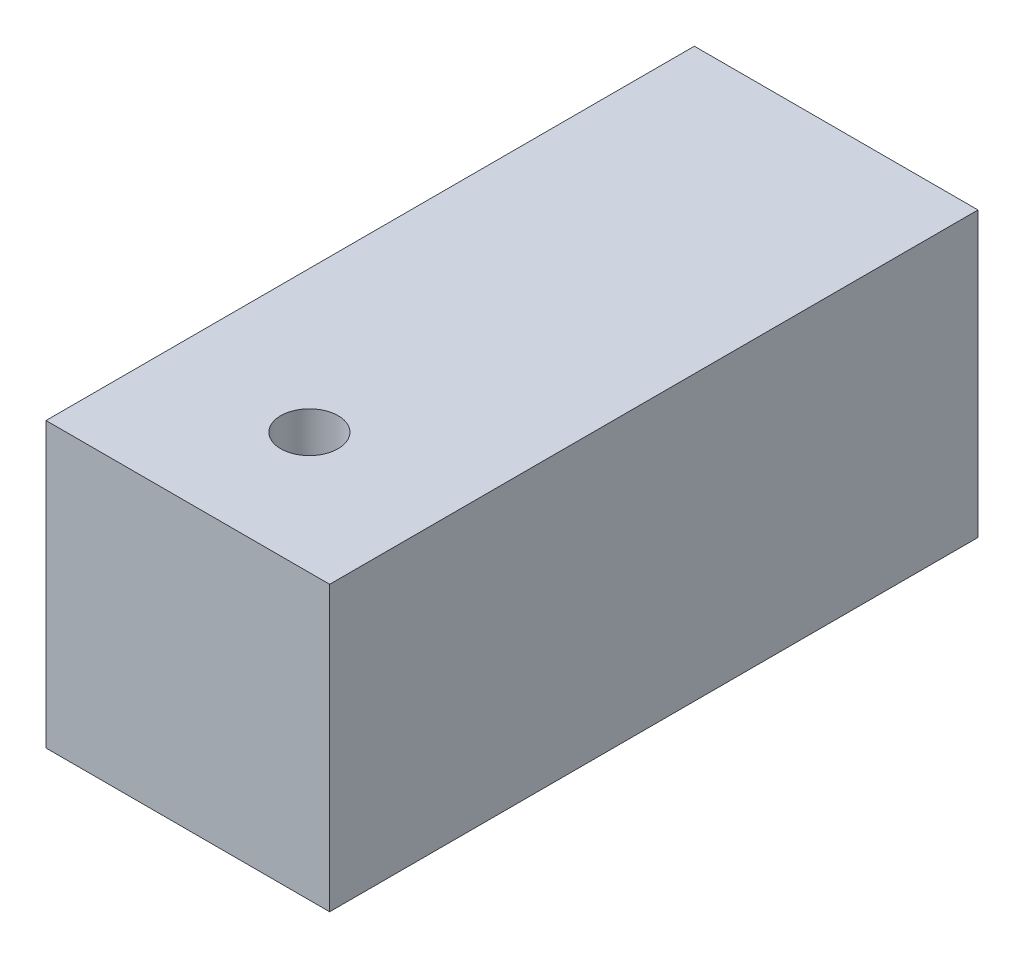
ISO-10303-21;
HEADER;
FILE_DESCRIPTION(('STEP AP214'),'2;1');
FILE_NAME('part.step','',(''),(''),'','','');
FILE_SCHEMA(('AUTOMOTIVE_DESIGN { 1 0 10303 214 1 1 1 1 }'));
ENDSEC;
DATA;
#1=APPLICATION_CONTEXT('core data for automotive mechanical design processes');
#2=APPLICATION_PROTOCOL_DEFINITION('international standard','automotive_design',2000,#1);
#3=PRODUCT_CONTEXT('',#1,'mechanical');
#4=PRODUCT('Part','Part','',(#3));
#5=PRODUCT_RELATED_PRODUCT_CATEGORY('part','',(#4));
#6=PRODUCT_DEFINITION_FORMATION('','',#4);
#7=PRODUCT_DEFINITION_CONTEXT('part definition',#1,'design');
#8=PRODUCT_DEFINITION('design','',#6,#7);
#9=PRODUCT_DEFINITION_SHAPE('','',#8);
#10=(LENGTH_UNIT() NAMED_UNIT(*) SI_UNIT(.MILLI.,.METRE.));
#11=(NAMED_UNIT(*) PLANE_ANGLE_UNIT() SI_UNIT($,.RADIAN.));
#12=(NAMED_UNIT(*) SI_UNIT($,.STERADIAN.) SOLID_ANGLE_UNIT());
#13=UNCERTAINTY_MEASURE_WITH_UNIT(LENGTH_MEASURE(1.E-05),#10,'distance_accuracy_value','');
#14=(GEOMETRIC_REPRESENTATION_CONTEXT(3) GLOBAL_UNCERTAINTY_ASSIGNED_CONTEXT((#13)) GLOBAL_UNIT_ASSIGNED_CONTEXT((#10,
#11,#12)) REPRESENTATION_CONTEXT('',''));
#15=CARTESIAN_POINT('',(0.,0.,0.));
#16=DIRECTION('',(0.,0.,1.));
#17=DIRECTION('',(1.,0.,0.));
#18=AXIS2_PLACEMENT_3D('',#15,#16,#17);
#19=CARTESIAN_POINT('',(11.1125,11.1125,50.8));
#20=DIRECTION('',(-1.,0.,0.));
#21=DIRECTION('',(0.,-1.,0.));
#22=AXIS2_PLACEMENT_3D('',#19,#20,#21);
#23=PLANE('',#22);
#24=DIRECTION('',(0.,1.,0.));
#25=VECTOR('',#24,1.);
#26=CARTESIAN_POINT('',(11.1125,11.1125,0.));
#27=LINE('',#26,#25);
#28=CARTESIAN_POINT('',(11.1125,-11.1125,0.));
#29=VERTEX_POINT('',#28);
#30=CARTESIAN_POINT('',(11.1125,11.1125,0.));
#31=VERTEX_POINT('',#30);
#32=EDGE_CURVE('E191',#29,#31,#27,.T.);
#33=ORIENTED_EDGE('',*,*,#32,.T.);
#34=DIRECTION('',(0.,0.,-1.));
#35=VECTOR('',#34,1.);
#36=CARTESIAN_POINT('',(11.1125,11.1125,50.8));
#37=LINE('',#36,#35);
#38=CARTESIAN_POINT('',(11.1125,11.1125,50.8));
#39=VERTEX_POINT('',#38);
#40=EDGE_CURVE('E233',#39,#31,#37,.T.);
#41=ORIENTED_EDGE('',*,*,#40,.F.);
#42=DIRECTION('',(0.,1.,0.));
#43=VECTOR('',#42,1.);
#44=CARTESIAN_POINT('',(11.1125,11.1125,50.8));
#45=LINE('',#44,#43);
#46=CARTESIAN_POINT('',(11.1125,-11.1125,50.8));
#47=VERTEX_POINT('',#46);
#48=EDGE_CURVE('E207',#47,#39,#45,.T.);
#49=ORIENTED_EDGE('',*,*,#48,.F.);
#50=DIRECTION('',(0.,0.,-1.));
#51=VECTOR('',#50,1.);
#52=CARTESIAN_POINT('',(11.1125,-11.1125,50.8));
#53=LINE('',#52,#51);
#54=EDGE_CURVE('E217',#47,#29,#53,.T.);
#55=ORIENTED_EDGE('',*,*,#54,.T.);
#56=EDGE_LOOP('',(#33,#41,#49,#55));
#57=FACE_BOUND('',#56,.T.);
#58=ADVANCED_FACE('F35',(#57),#23,.F.);
#59=CARTESIAN_POINT('',(-11.1125,11.1125,50.8));
#60=DIRECTION('',(0.,-1.,0.));
#61=DIRECTION('',(0.,0.,-1.));
#62=AXIS2_PLACEMENT_3D('',#59,#60,#61);
#63=PLANE('',#62);
#64=CARTESIAN_POINT('',(0.,11.1125,41.275));
#65=DIRECTION('',(0.,-1.,0.));
#66=DIRECTION('',(0.,0.,-1.));
#67=AXIS2_PLACEMENT_3D('',#64,#65,#66);
#68=CIRCLE('',#67,2.2479);
#69=CARTESIAN_POINT('',(0.,11.1125,39.0271));
#70=VERTEX_POINT('',#69);
#71=EDGE_CURVE('E170',#70,#70,#68,.T.);
#72=ORIENTED_EDGE('',*,*,#71,.T.);
#73=EDGE_LOOP('',(#72));
#74=FACE_BOUND('',#73,.T.);
#75=DIRECTION('',(-1.,0.,0.));
#76=VECTOR('',#75,1.);
#77=CARTESIAN_POINT('',(-11.1125,11.1125,0.));
#78=LINE('',#77,#76);
#79=CARTESIAN_POINT('',(-11.1125,11.1125,0.));
#80=VERTEX_POINT('',#79);
#81=EDGE_CURVE('E220',#31,#80,#78,.T.);
#82=ORIENTED_EDGE('',*,*,#81,.T.);
#83=DIRECTION('',(0.,0.,-1.));
#84=VECTOR('',#83,1.);
#85=CARTESIAN_POINT('',(-11.1125,11.1125,50.8));
#86=LINE('',#85,#84);
#87=CARTESIAN_POINT('',(-11.1125,11.1125,50.8));
#88=VERTEX_POINT('',#87);
#89=EDGE_CURVE('E230',#88,#80,#86,.T.);
#90=ORIENTED_EDGE('',*,*,#89,.F.);
#91=DIRECTION('',(-1.,0.,0.));
#92=VECTOR('',#91,1.);
#93=CARTESIAN_POINT('',(-11.1125,11.1125,50.8));
#94=LINE('',#93,#92);
#95=EDGE_CURVE('E210',#39,#88,#94,.T.);
#96=ORIENTED_EDGE('',*,*,#95,.F.);
#97=ORIENTED_EDGE('',*,*,#40,.T.);
#98=EDGE_LOOP('',(#82,#90,#96,#97));
#99=FACE_BOUND('',#98,.T.);
#100=ADVANCED_FACE('F308',(#74,#99),#63,.F.);
#101=CARTESIAN_POINT('',(-11.1125,11.1125,50.8));
#102=DIRECTION('',(1.,0.,0.));
#103=DIRECTION('',(0.,1.,0.));
#104=AXIS2_PLACEMENT_3D('',#101,#102,#103);
#105=PLANE('',#104);
#106=DIRECTION('',(0.,-1.,0.));
#107=VECTOR('',#106,1.);
#108=CARTESIAN_POINT('',(-11.1125,11.1125,0.));
#109=LINE('',#108,#107);
#110=CARTESIAN_POINT('',(-11.1125,-11.1125,0.));
#111=VERTEX_POINT('',#110);
#112=EDGE_CURVE('E222',#80,#111,#109,.T.);
#113=ORIENTED_EDGE('',*,*,#112,.T.);
#114=DIRECTION('',(0.,0.,-1.));
#115=VECTOR('',#114,1.);
#116=CARTESIAN_POINT('',(-11.1125,-11.1125,50.8));
#117=LINE('',#116,#115);
#118=CARTESIAN_POINT('',(-11.1125,-11.1125,50.8));
#119=VERTEX_POINT('',#118);
#120=EDGE_CURVE('E227',#119,#111,#117,.T.);
#121=ORIENTED_EDGE('',*,*,#120,.F.);
#122=DIRECTION('',(0.,-1.,0.));
#123=VECTOR('',#122,1.);
#124=CARTESIAN_POINT('',(-11.1125,11.1125,50.8));
#125=LINE('',#124,#123);
#126=EDGE_CURVE('E213',#88,#119,#125,.T.);
#127=ORIENTED_EDGE('',*,*,#126,.F.);
#128=ORIENTED_EDGE('',*,*,#89,.T.);
#129=EDGE_LOOP('',(#113,#121,#127,#128));
#130=FACE_BOUND('',#129,.T.);
#131=ADVANCED_FACE('F314',(#130),#105,.F.);
#132=CARTESIAN_POINT('',(-11.1125,-11.1125,50.8));
#133=DIRECTION('',(0.,1.,0.));
#134=DIRECTION('',(0.,0.,1.));
#135=AXIS2_PLACEMENT_3D('',#132,#133,#134);
#136=PLANE('',#135);
#137=DIRECTION('',(0.,0.,-1.));
#138=VECTOR('',#137,1.);
#139=CARTESIAN_POINT('',(-4.34975,-11.1125,50.8));
#140=LINE('',#139,#138);
#141=CARTESIAN_POINT('',(-4.34975,-11.1125,38.1));
#142=VERTEX_POINT('',#141);
#143=CARTESIAN_POINT('',(-4.34975,-11.1125,44.45));
#144=VERTEX_POINT('',#143);
#145=EDGE_CURVE('E237',#142,#144,#140,.F.);
#146=ORIENTED_EDGE('',*,*,#145,.T.);
#147=CARTESIAN_POINT('',(-0.79375,-11.1125,44.45));
#148=DIRECTION('',(0.,1.,0.));
#149=DIRECTION('',(0.,0.,1.));
#150=AXIS2_PLACEMENT_3D('',#147,#148,#149);
#151=CIRCLE('',#150,3.556);
#152=CARTESIAN_POINT('',(-0.79375,-11.1125,48.006));
#153=VERTEX_POINT('',#152);
#154=EDGE_CURVE('E251',#144,#153,#151,.T.);
#155=ORIENTED_EDGE('',*,*,#154,.T.);
#156=DIRECTION('',(1.,0.,0.));
#157=VECTOR('',#156,1.);
#158=CARTESIAN_POINT('',(0.793750000000001,-11.1125,48.006));
#159=LINE('',#158,#157);
#160=CARTESIAN_POINT('',(0.793750000000001,-11.1125,48.006));
#161=VERTEX_POINT('',#160);
#162=EDGE_CURVE('E249',#153,#161,#159,.T.);
#163=ORIENTED_EDGE('',*,*,#162,.T.);
#164=CARTESIAN_POINT('',(0.79375,-11.1125,44.45));
#165=DIRECTION('',(0.,1.,0.));
#166=DIRECTION('',(0.,0.,1.));
#167=AXIS2_PLACEMENT_3D('',#164,#165,#166);
#168=CIRCLE('',#167,3.556);
#169=CARTESIAN_POINT('',(4.34975,-11.1125,44.45));
#170=VERTEX_POINT('',#169);
#171=EDGE_CURVE('E247',#161,#170,#168,.T.);
#172=ORIENTED_EDGE('',*,*,#171,.T.);
#173=DIRECTION('',(0.,0.,-1.));
#174=VECTOR('',#173,1.);
#175=CARTESIAN_POINT('',(4.34975,-11.1125,38.1));
#176=LINE('',#175,#174);
#177=CARTESIAN_POINT('',(4.34975,-11.1125,38.1));
#178=VERTEX_POINT('',#177);
#179=EDGE_CURVE('E245',#170,#178,#176,.T.);
#180=ORIENTED_EDGE('',*,*,#179,.T.);
#181=CARTESIAN_POINT('',(0.79375,-11.1125,38.1));
#182=DIRECTION('',(0.,1.,0.));
#183=DIRECTION('',(0.,0.,1.));
#184=AXIS2_PLACEMENT_3D('',#181,#182,#183);
#185=CIRCLE('',#184,3.556);
#186=CARTESIAN_POINT('',(0.79375,-11.1125,34.544));
#187=VERTEX_POINT('',#186);
#188=EDGE_CURVE('E243',#178,#187,#185,.T.);
#189=ORIENTED_EDGE('',*,*,#188,.T.);
#190=DIRECTION('',(1.,0.,0.));
#191=VECTOR('',#190,1.);
#192=CARTESIAN_POINT('',(-11.1125,-11.1125,34.544));
#193=LINE('',#192,#191);
#194=CARTESIAN_POINT('',(-0.79375,-11.1125,34.544));
#195=VERTEX_POINT('',#194);
#196=EDGE_CURVE('E241',#187,#195,#193,.F.);
#197=ORIENTED_EDGE('',*,*,#196,.T.);
#198=CARTESIAN_POINT('',(-0.79375,-11.1125,38.1));
#199=DIRECTION('',(0.,1.,0.));
#200=DIRECTION('',(0.,0.,1.));
#201=AXIS2_PLACEMENT_3D('',#198,#199,#200);
#202=CIRCLE('',#201,3.556);
#203=EDGE_CURVE('E239',#195,#142,#202,.T.);
#204=ORIENTED_EDGE('',*,*,#203,.T.);
#205=EDGE_LOOP('',(#146,#155,#163,#172,#180,#189,#197,#204));
#206=FACE_BOUND('',#205,.T.);
#207=DIRECTION('',(1.,0.,0.));
#208=VECTOR('',#207,1.);
#209=CARTESIAN_POINT('',(-11.1125,-11.1125,0.));
#210=LINE('',#209,#208);
#211=EDGE_CURVE('E211',#111,#29,#210,.T.);
#212=ORIENTED_EDGE('',*,*,#211,.T.);
#213=ORIENTED_EDGE('',*,*,#54,.F.);
#214=DIRECTION('',(1.,0.,0.));
#215=VECTOR('',#214,1.);
#216=CARTESIAN_POINT('',(-11.1125,-11.1125,50.8));
#217=LINE('',#216,#215);
#218=EDGE_CURVE('E215',#119,#47,#217,.T.);
#219=ORIENTED_EDGE('',*,*,#218,.F.);
#220=ORIENTED_EDGE('',*,*,#120,.T.);
#221=EDGE_LOOP('',(#212,#213,#219,#220));
#222=FACE_BOUND('',#221,.T.);
#223=ADVANCED_FACE('F354',(#206,#222),#136,.F.);
#224=CARTESIAN_POINT('',(0.,0.,50.8));
#225=DIRECTION('',(0.,0.,1.));
#226=DIRECTION('',(1.,0.,0.));
#227=AXIS2_PLACEMENT_3D('',#224,#225,#226);
#228=PLANE('',#227);
#229=ORIENTED_EDGE('',*,*,#48,.T.);
#230=ORIENTED_EDGE('',*,*,#95,.T.);
#231=ORIENTED_EDGE('',*,*,#126,.T.);
#232=ORIENTED_EDGE('',*,*,#218,.T.);
#233=EDGE_LOOP('',(#229,#230,#231,#232));
#234=FACE_BOUND('',#233,.T.);
#235=ADVANCED_FACE('F396',(#234),#228,.T.);
#236=CARTESIAN_POINT('',(0.,0.,0.));
#237=DIRECTION('',(0.,0.,1.));
#238=DIRECTION('',(1.,0.,0.));
#239=AXIS2_PLACEMENT_3D('',#236,#237,#238);
#240=PLANE('',#239);
#241=ORIENTED_EDGE('',*,*,#32,.F.);
#242=ORIENTED_EDGE('',*,*,#211,.F.);
#243=ORIENTED_EDGE('',*,*,#112,.F.);
#244=ORIENTED_EDGE('',*,*,#81,.F.);
#245=EDGE_LOOP('',(#241,#242,#243,#244));
#246=FACE_BOUND('',#245,.T.);
#247=ADVANCED_FACE('F380',(#246),#240,.F.);
#248=CARTESIAN_POINT('',(-0.79375,1.5875,44.45));
#249=DIRECTION('',(0.,-1.,0.));
#250=DIRECTION('',(0.,0.,-1.));
#251=AXIS2_PLACEMENT_3D('',#248,#249,#250);
#252=CYLINDRICAL_SURFACE('',#251,3.175);
#253=DIRECTION('',(0.,-1.,0.));
#254=VECTOR('',#253,1.);
#255=CARTESIAN_POINT('',(-0.79375,1.5875,47.625));
#256=LINE('',#255,#254);
#257=CARTESIAN_POINT('',(-0.79375,1.5875,47.625));
#258=VERTEX_POINT('',#257);
#259=CARTESIAN_POINT('',(-0.79375,-10.7315,47.625));
#260=VERTEX_POINT('',#259);
#261=EDGE_CURVE('E189',#258,#260,#256,.T.);
#262=ORIENTED_EDGE('',*,*,#261,.T.);
#263=CARTESIAN_POINT('',(-0.79375,-10.7315,44.45));
#264=DIRECTION('',(0.,1.,0.));
#265=DIRECTION('',(0.,0.,1.));
#266=AXIS2_PLACEMENT_3D('',#263,#264,#265);
#267=CIRCLE('',#266,3.175);
#268=CARTESIAN_POINT('',(-3.96875,-10.7315,44.45));
#269=VERTEX_POINT('',#268);
#270=EDGE_CURVE('E155',#260,#269,#267,.F.);
#271=ORIENTED_EDGE('',*,*,#270,.T.);
#272=DIRECTION('',(0.,-1.,0.));
#273=VECTOR('',#272,1.);
#274=CARTESIAN_POINT('',(-3.96875,1.5875,44.45));
#275=LINE('',#274,#273);
#276=CARTESIAN_POINT('',(-3.96875,1.5875,44.45));
#277=VERTEX_POINT('',#276);
#278=EDGE_CURVE('E148',#277,#269,#275,.T.);
#279=ORIENTED_EDGE('',*,*,#278,.F.);
#280=CARTESIAN_POINT('',(-0.79375,1.5875,44.45));
#281=DIRECTION('',(0.,-1.,0.));
#282=DIRECTION('',(0.,0.,-1.));
#283=AXIS2_PLACEMENT_3D('',#280,#281,#282);
#284=CIRCLE('',#283,3.175);
#285=EDGE_CURVE('E153',#258,#277,#284,.T.);
#286=ORIENTED_EDGE('',*,*,#285,.F.);
#287=EDGE_LOOP('',(#262,#271,#279,#286));
#288=FACE_BOUND('',#287,.T.);
#289=ADVANCED_FACE('F151',(#288),#252,.F.);
#290=CARTESIAN_POINT('',(-0.79375,1.5875,47.625));
#291=DIRECTION('',(0.,0.,-1.));
#292=DIRECTION('',(-1.,0.,0.));
#293=AXIS2_PLACEMENT_3D('',#290,#291,#292);
#294=PLANE('',#293);
#295=DIRECTION('',(0.,-1.,0.));
#296=VECTOR('',#295,1.);
#297=CARTESIAN_POINT('',(0.793750000000001,1.5875,47.625));
#298=LINE('',#297,#296);
#299=CARTESIAN_POINT('',(0.793750000000001,1.5875,47.625));
#300=VERTEX_POINT('',#299);
#301=CARTESIAN_POINT('',(0.793750000000001,-10.7315,47.625));
#302=VERTEX_POINT('',#301);
#303=EDGE_CURVE('E192',#300,#302,#298,.T.);
#304=ORIENTED_EDGE('',*,*,#303,.T.);
#305=DIRECTION('',(1.,0.,0.));
#306=VECTOR('',#305,1.);
#307=CARTESIAN_POINT('',(-0.793750000000001,-10.7315,47.625));
#308=LINE('',#307,#306);
#309=EDGE_CURVE('E254',#302,#260,#308,.F.);
#310=ORIENTED_EDGE('',*,*,#309,.T.);
#311=ORIENTED_EDGE('',*,*,#261,.F.);
#312=DIRECTION('',(1.,0.,0.));
#313=VECTOR('',#312,1.);
#314=CARTESIAN_POINT('',(-0.79375,1.5875,47.625));
#315=LINE('',#314,#313);
#316=EDGE_CURVE('E157',#258,#300,#315,.T.);
#317=ORIENTED_EDGE('',*,*,#316,.T.);
#318=EDGE_LOOP('',(#304,#310,#311,#317));
#319=FACE_BOUND('',#318,.T.);
#320=ADVANCED_FACE('F367',(#319),#294,.T.);
#321=CARTESIAN_POINT('',(0.79375,1.5875,44.45));
#322=DIRECTION('',(0.,-1.,0.));
#323=DIRECTION('',(0.,0.,-1.));
#324=AXIS2_PLACEMENT_3D('',#321,#322,#323);
#325=CYLINDRICAL_SURFACE('',#324,3.175);
#326=DIRECTION('',(0.,-1.,0.));
#327=VECTOR('',#326,1.);
#328=CARTESIAN_POINT('',(3.96875,1.5875,44.45));
#329=LINE('',#328,#327);
#330=CARTESIAN_POINT('',(3.96875,1.5875,44.45));
#331=VERTEX_POINT('',#330);
#332=CARTESIAN_POINT('',(3.96875,-10.7315,44.45));
#333=VERTEX_POINT('',#332);
#334=EDGE_CURVE('E195',#331,#333,#329,.T.);
#335=ORIENTED_EDGE('',*,*,#334,.T.);
#336=CARTESIAN_POINT('',(0.79375,-10.7315,44.45));
#337=DIRECTION('',(0.,1.,0.));
#338=DIRECTION('',(0.,0.,1.));
#339=AXIS2_PLACEMENT_3D('',#336,#337,#338);
#340=CIRCLE('',#339,3.175);
#341=EDGE_CURVE('E256',#333,#302,#340,.F.);
#342=ORIENTED_EDGE('',*,*,#341,.T.);
#343=ORIENTED_EDGE('',*,*,#303,.F.);
#344=CARTESIAN_POINT('',(0.79375,1.5875,44.45));
#345=DIRECTION('',(0.,-1.,0.));
#346=DIRECTION('',(0.,0.,-1.));
#347=AXIS2_PLACEMENT_3D('',#344,#345,#346);
#348=CIRCLE('',#347,3.175);
#349=EDGE_CURVE('E186',#331,#300,#348,.T.);
#350=ORIENTED_EDGE('',*,*,#349,.F.);
#351=EDGE_LOOP('',(#335,#342,#343,#350));
#352=FACE_BOUND('',#351,.T.);
#353=ADVANCED_FACE('F364',(#352),#325,.F.);
#354=CARTESIAN_POINT('',(3.96875,1.5875,44.45));
#355=DIRECTION('',(-1.,0.,0.));
#356=DIRECTION('',(0.,0.,1.));
#357=AXIS2_PLACEMENT_3D('',#354,#355,#356);
#358=PLANE('',#357);
#359=DIRECTION('',(0.,-1.,0.));
#360=VECTOR('',#359,1.);
#361=CARTESIAN_POINT('',(3.96875,1.5875,38.1));
#362=LINE('',#361,#360);
#363=CARTESIAN_POINT('',(3.96875,1.5875,38.1));
#364=VERTEX_POINT('',#363);
#365=CARTESIAN_POINT('',(3.96875,-10.7315,38.1));
#366=VERTEX_POINT('',#365);
#367=EDGE_CURVE('E198',#364,#366,#362,.T.);
#368=ORIENTED_EDGE('',*,*,#367,.T.);
#369=DIRECTION('',(0.,0.,-1.));
#370=VECTOR('',#369,1.);
#371=CARTESIAN_POINT('',(3.96875,-10.7315,44.45));
#372=LINE('',#371,#370);
#373=EDGE_CURVE('E258',#366,#333,#372,.F.);
#374=ORIENTED_EDGE('',*,*,#373,.T.);
#375=ORIENTED_EDGE('',*,*,#334,.F.);
#376=DIRECTION('',(0.,0.,-1.));
#377=VECTOR('',#376,1.);
#378=CARTESIAN_POINT('',(3.96875,1.5875,44.45));
#379=LINE('',#378,#377);
#380=EDGE_CURVE('E184',#331,#364,#379,.T.);
#381=ORIENTED_EDGE('',*,*,#380,.T.);
#382=EDGE_LOOP('',(#368,#374,#375,#381));
#383=FACE_BOUND('',#382,.T.);
#384=ADVANCED_FACE('F378',(#383),#358,.T.);
#385=CARTESIAN_POINT('',(0.79375,1.5875,38.1));
#386=DIRECTION('',(0.,-1.,0.));
#387=DIRECTION('',(0.,0.,-1.));
#388=AXIS2_PLACEMENT_3D('',#385,#386,#387);
#389=CYLINDRICAL_SURFACE('',#388,3.175);
#390=DIRECTION('',(0.,-1.,0.));
#391=VECTOR('',#390,1.);
#392=CARTESIAN_POINT('',(0.79375,1.5875,34.925));
#393=LINE('',#392,#391);
#394=CARTESIAN_POINT('',(0.79375,1.5875,34.925));
#395=VERTEX_POINT('',#394);
#396=CARTESIAN_POINT('',(0.79375,-10.7315,34.925));
#397=VERTEX_POINT('',#396);
#398=EDGE_CURVE('E201',#395,#397,#393,.T.);
#399=ORIENTED_EDGE('',*,*,#398,.T.);
#400=CARTESIAN_POINT('',(0.79375,-10.7315,38.1));
#401=DIRECTION('',(0.,1.,0.));
#402=DIRECTION('',(0.,0.,1.));
#403=AXIS2_PLACEMENT_3D('',#400,#401,#402);
#404=CIRCLE('',#403,3.175);
#405=EDGE_CURVE('E260',#397,#366,#404,.F.);
#406=ORIENTED_EDGE('',*,*,#405,.T.);
#407=ORIENTED_EDGE('',*,*,#367,.F.);
#408=CARTESIAN_POINT('',(0.79375,1.5875,38.1));
#409=DIRECTION('',(0.,-1.,0.));
#410=DIRECTION('',(0.,0.,-1.));
#411=AXIS2_PLACEMENT_3D('',#408,#409,#410);
#412=CIRCLE('',#411,3.175);
#413=EDGE_CURVE('E181',#395,#364,#412,.T.);
#414=ORIENTED_EDGE('',*,*,#413,.F.);
#415=EDGE_LOOP('',(#399,#406,#407,#414));
#416=FACE_BOUND('',#415,.T.);
#417=ADVANCED_FACE('F385',(#416),#389,.F.);
#418=CARTESIAN_POINT('',(-0.79375,1.5875,34.925));
#419=DIRECTION('',(0.,0.,-1.));
#420=DIRECTION('',(-1.,0.,0.));
#421=AXIS2_PLACEMENT_3D('',#418,#419,#420);
#422=PLANE('',#421);
#423=DIRECTION('',(0.,-1.,0.));
#424=VECTOR('',#423,1.);
#425=CARTESIAN_POINT('',(-0.79375,1.5875,34.925));
#426=LINE('',#425,#424);
#427=CARTESIAN_POINT('',(-0.79375,1.5875,34.925));
#428=VERTEX_POINT('',#427);
#429=CARTESIAN_POINT('',(-0.79375,-10.7315,34.925));
#430=VERTEX_POINT('',#429);
#431=EDGE_CURVE('E204',#428,#430,#426,.T.);
#432=ORIENTED_EDGE('',*,*,#431,.T.);
#433=DIRECTION('',(1.,0.,0.));
#434=VECTOR('',#433,1.);
#435=CARTESIAN_POINT('',(-0.79375,-10.7315,34.925));
#436=LINE('',#435,#434);
#437=EDGE_CURVE('E262',#430,#397,#436,.T.);
#438=ORIENTED_EDGE('',*,*,#437,.T.);
#439=ORIENTED_EDGE('',*,*,#398,.F.);
#440=DIRECTION('',(1.,0.,0.));
#441=VECTOR('',#440,1.);
#442=CARTESIAN_POINT('',(-0.79375,1.5875,34.925));
#443=LINE('',#442,#441);
#444=EDGE_CURVE('E178',#428,#395,#443,.T.);
#445=ORIENTED_EDGE('',*,*,#444,.F.);
#446=EDGE_LOOP('',(#432,#438,#439,#445));
#447=FACE_BOUND('',#446,.T.);
#448=ADVANCED_FACE('F389',(#447),#422,.F.);
#449=CARTESIAN_POINT('',(-0.79375,1.5875,38.1));
#450=DIRECTION('',(0.,-1.,0.));
#451=DIRECTION('',(0.,0.,-1.));
#452=AXIS2_PLACEMENT_3D('',#449,#450,#451);
#453=CYLINDRICAL_SURFACE('',#452,3.175);
#454=DIRECTION('',(0.,-1.,0.));
#455=VECTOR('',#454,1.);
#456=CARTESIAN_POINT('',(-3.96875,1.5875,38.1));
#457=LINE('',#456,#455);
#458=CARTESIAN_POINT('',(-3.96875,1.5875,38.1));
#459=VERTEX_POINT('',#458);
#460=CARTESIAN_POINT('',(-3.96875,-10.7315,38.1));
#461=VERTEX_POINT('',#460);
#462=EDGE_CURVE('E156',#459,#461,#457,.T.);
#463=ORIENTED_EDGE('',*,*,#462,.T.);
#464=CARTESIAN_POINT('',(-0.79375,-10.7315,38.1));
#465=DIRECTION('',(0.,1.,0.));
#466=DIRECTION('',(0.,0.,1.));
#467=AXIS2_PLACEMENT_3D('',#464,#465,#466);
#468=CIRCLE('',#467,3.175);
#469=EDGE_CURVE('E44',#461,#430,#468,.F.);
#470=ORIENTED_EDGE('',*,*,#469,.T.);
#471=ORIENTED_EDGE('',*,*,#431,.F.);
#472=CARTESIAN_POINT('',(-0.79375,1.5875,38.1));
#473=DIRECTION('',(0.,-1.,0.));
#474=DIRECTION('',(0.,0.,-1.));
#475=AXIS2_PLACEMENT_3D('',#472,#473,#474);
#476=CIRCLE('',#475,3.175);
#477=EDGE_CURVE('E165',#459,#428,#476,.T.);
#478=ORIENTED_EDGE('',*,*,#477,.F.);
#479=EDGE_LOOP('',(#463,#470,#471,#478));
#480=FACE_BOUND('',#479,.T.);
#481=ADVANCED_FACE('F304',(#480),#453,.F.);
#482=CARTESIAN_POINT('',(-3.96875,1.5875,44.45));
#483=DIRECTION('',(-1.,0.,0.));
#484=DIRECTION('',(0.,0.,1.));
#485=AXIS2_PLACEMENT_3D('',#482,#483,#484);
#486=PLANE('',#485);
#487=ORIENTED_EDGE('',*,*,#278,.T.);
#488=DIRECTION('',(0.,0.,-1.));
#489=VECTOR('',#488,1.);
#490=CARTESIAN_POINT('',(-3.96875,-10.7315,44.45));
#491=LINE('',#490,#489);
#492=EDGE_CURVE('E11',#269,#461,#491,.T.);
#493=ORIENTED_EDGE('',*,*,#492,.T.);
#494=ORIENTED_EDGE('',*,*,#462,.F.);
#495=DIRECTION('',(0.,0.,-1.));
#496=VECTOR('',#495,1.);
#497=CARTESIAN_POINT('',(-3.96875,1.5875,44.45));
#498=LINE('',#497,#496);
#499=EDGE_CURVE('E160',#277,#459,#498,.T.);
#500=ORIENTED_EDGE('',*,*,#499,.F.);
#501=EDGE_LOOP('',(#487,#493,#494,#500));
#502=FACE_BOUND('',#501,.T.);
#503=ADVANCED_FACE('F161',(#502),#486,.F.);
#504=CARTESIAN_POINT('',(-0.79375,1.5875,44.45));
#505=DIRECTION('',(0.,-1.,0.));
#506=DIRECTION('',(0.,0.,-1.));
#507=AXIS2_PLACEMENT_3D('',#504,#505,#506);
#508=PLANE('',#507);
#509=CARTESIAN_POINT('',(0.,1.5875,41.275));
#510=DIRECTION('',(0.,-1.,0.));
#511=DIRECTION('',(0.,0.,-1.));
#512=AXIS2_PLACEMENT_3D('',#509,#510,#511);
#513=CIRCLE('',#512,2.2479);
#514=CARTESIAN_POINT('',(0.,1.5875,39.0271));
#515=VERTEX_POINT('',#514);
#516=EDGE_CURVE('E173',#515,#515,#513,.T.);
#517=ORIENTED_EDGE('',*,*,#516,.F.);
#518=EDGE_LOOP('',(#517));
#519=FACE_BOUND('',#518,.T.);
#520=ORIENTED_EDGE('',*,*,#285,.T.);
#521=ORIENTED_EDGE('',*,*,#499,.T.);
#522=ORIENTED_EDGE('',*,*,#477,.T.);
#523=ORIENTED_EDGE('',*,*,#444,.T.);
#524=ORIENTED_EDGE('',*,*,#413,.T.);
#525=ORIENTED_EDGE('',*,*,#380,.F.);
#526=ORIENTED_EDGE('',*,*,#349,.T.);
#527=ORIENTED_EDGE('',*,*,#316,.F.);
#528=EDGE_LOOP('',(#520,#521,#522,#523,#524,#525,#526,#527));
#529=FACE_BOUND('',#528,.T.);
#530=ADVANCED_FACE('F168',(#519,#529),#508,.T.);
#531=CARTESIAN_POINT('',(0.,1.5875,41.275));
#532=DIRECTION('',(0.,-1.,0.));
#533=DIRECTION('',(0.,0.,-1.));
#534=AXIS2_PLACEMENT_3D('',#531,#532,#533);
#535=CYLINDRICAL_SURFACE('',#534,2.2479);
#536=ORIENTED_EDGE('',*,*,#71,.F.);
#537=EDGE_LOOP('',(#536));
#538=FACE_BOUND('',#537,.T.);
#539=ORIENTED_EDGE('',*,*,#516,.T.);
#540=EDGE_LOOP('',(#539));
#541=FACE_BOUND('',#540,.T.);
#542=ADVANCED_FACE('F294',(#538,#541),#535,.F.);
#543=CARTESIAN_POINT('',(0.79375,-10.7315,38.1));
#544=DIRECTION('',(0.,1.,0.));
#545=DIRECTION('',(0.,0.,1.));
#546=AXIS2_PLACEMENT_3D('',#543,#544,#545);
#547=TOROIDAL_SURFACE('',#546,3.556,0.381);
#548=CARTESIAN_POINT('',(0.79375,-10.7315,34.544));
#549=DIRECTION('',(-1.,0.,0.));
#550=DIRECTION('',(0.,0.,1.));
#551=AXIS2_PLACEMENT_3D('',#548,#549,#550);
#552=CIRCLE('',#551,0.381);
#553=EDGE_CURVE('E280',#187,#397,#552,.T.);
#554=ORIENTED_EDGE('',*,*,#553,.F.);
#555=ORIENTED_EDGE('',*,*,#188,.F.);
#556=CARTESIAN_POINT('',(4.34975,-10.7315,38.1));
#557=DIRECTION('',(0.,0.,1.));
#558=DIRECTION('',(1.,0.,0.));
#559=AXIS2_PLACEMENT_3D('',#556,#557,#558);
#560=CIRCLE('',#559,0.381);
#561=EDGE_CURVE('E39',#366,#178,#560,.T.);
#562=ORIENTED_EDGE('',*,*,#561,.F.);
#563=ORIENTED_EDGE('',*,*,#405,.F.);
#564=EDGE_LOOP('',(#554,#555,#562,#563));
#565=FACE_BOUND('',#564,.T.);
#566=ADVANCED_FACE('F37',(#565),#547,.T.);
#567=CARTESIAN_POINT('',(4.34975,-10.7315,50.8));
#568=DIRECTION('',(0.,0.,1.));
#569=DIRECTION('',(1.,0.,0.));
#570=AXIS2_PLACEMENT_3D('',#567,#568,#569);
#571=CYLINDRICAL_SURFACE('',#570,0.381);
#572=ORIENTED_EDGE('',*,*,#561,.T.);
#573=ORIENTED_EDGE('',*,*,#179,.F.);
#574=CARTESIAN_POINT('',(4.34975,-10.7315,44.45));
#575=DIRECTION('',(0.,0.,1.));
#576=DIRECTION('',(1.,0.,0.));
#577=AXIS2_PLACEMENT_3D('',#574,#575,#576);
#578=CIRCLE('',#577,0.381);
#579=EDGE_CURVE('E278',#333,#170,#578,.T.);
#580=ORIENTED_EDGE('',*,*,#579,.F.);
#581=ORIENTED_EDGE('',*,*,#373,.F.);
#582=EDGE_LOOP('',(#572,#573,#580,#581));
#583=FACE_BOUND('',#582,.T.);
#584=ADVANCED_FACE('F341',(#583),#571,.T.);
#585=CARTESIAN_POINT('',(-0.79375,-10.7315,34.544));
#586=DIRECTION('',(1.,0.,0.));
#587=DIRECTION('',(0.,0.,-1.));
#588=AXIS2_PLACEMENT_3D('',#585,#586,#587);
#589=CYLINDRICAL_SURFACE('',#588,0.381);
#590=ORIENTED_EDGE('',*,*,#553,.T.);
#591=ORIENTED_EDGE('',*,*,#437,.F.);
#592=CARTESIAN_POINT('',(-0.79375,-10.7315,34.544));
#593=DIRECTION('',(-1.,0.,0.));
#594=DIRECTION('',(0.,0.,1.));
#595=AXIS2_PLACEMENT_3D('',#592,#593,#594);
#596=CIRCLE('',#595,0.381);
#597=EDGE_CURVE('E275',#195,#430,#596,.T.);
#598=ORIENTED_EDGE('',*,*,#597,.F.);
#599=ORIENTED_EDGE('',*,*,#196,.F.);
#600=EDGE_LOOP('',(#590,#591,#598,#599));
#601=FACE_BOUND('',#600,.T.);
#602=ADVANCED_FACE('F338',(#601),#589,.T.);
#603=CARTESIAN_POINT('',(0.79375,-10.7315,44.45));
#604=DIRECTION('',(0.,1.,0.));
#605=DIRECTION('',(0.,0.,1.));
#606=AXIS2_PLACEMENT_3D('',#603,#604,#605);
#607=TOROIDAL_SURFACE('',#606,3.556,0.381);
#608=ORIENTED_EDGE('',*,*,#579,.T.);
#609=ORIENTED_EDGE('',*,*,#171,.F.);
#610=CARTESIAN_POINT('',(0.793750000000001,-10.7315,48.006));
#611=DIRECTION('',(-1.,0.,0.));
#612=DIRECTION('',(0.,0.,1.));
#613=AXIS2_PLACEMENT_3D('',#610,#611,#612);
#614=CIRCLE('',#613,0.381);
#615=EDGE_CURVE('E272',#302,#161,#614,.T.);
#616=ORIENTED_EDGE('',*,*,#615,.F.);
#617=ORIENTED_EDGE('',*,*,#341,.F.);
#618=EDGE_LOOP('',(#608,#609,#616,#617));
#619=FACE_BOUND('',#618,.T.);
#620=ADVANCED_FACE('F334',(#619),#607,.T.);
#621=CARTESIAN_POINT('',(-0.79375,-10.7315,38.1));
#622=DIRECTION('',(0.,1.,0.));
#623=DIRECTION('',(0.,0.,1.));
#624=AXIS2_PLACEMENT_3D('',#621,#622,#623);
#625=TOROIDAL_SURFACE('',#624,3.556,0.381);
#626=ORIENTED_EDGE('',*,*,#597,.T.);
#627=ORIENTED_EDGE('',*,*,#469,.F.);
#628=CARTESIAN_POINT('',(-4.34975,-10.7315,38.1));
#629=DIRECTION('',(0.,0.,1.));
#630=DIRECTION('',(1.,0.,0.));
#631=AXIS2_PLACEMENT_3D('',#628,#629,#630);
#632=CIRCLE('',#631,0.381);
#633=EDGE_CURVE('E269',#142,#461,#632,.T.);
#634=ORIENTED_EDGE('',*,*,#633,.F.);
#635=ORIENTED_EDGE('',*,*,#203,.F.);
#636=EDGE_LOOP('',(#626,#627,#634,#635));
#637=FACE_BOUND('',#636,.T.);
#638=ADVANCED_FACE('F330',(#637),#625,.T.);
#639=CARTESIAN_POINT('',(-11.1125,-10.7315,48.006));
#640=DIRECTION('',(-1.,0.,0.));
#641=DIRECTION('',(0.,0.,1.));
#642=AXIS2_PLACEMENT_3D('',#639,#640,#641);
#643=CYLINDRICAL_SURFACE('',#642,0.381);
#644=ORIENTED_EDGE('',*,*,#615,.T.);
#645=ORIENTED_EDGE('',*,*,#162,.F.);
#646=CARTESIAN_POINT('',(-0.79375,-10.7315,48.006));
#647=DIRECTION('',(-1.,0.,0.));
#648=DIRECTION('',(0.,0.,1.));
#649=AXIS2_PLACEMENT_3D('',#646,#647,#648);
#650=CIRCLE('',#649,0.381);
#651=EDGE_CURVE('E267',#260,#153,#650,.T.);
#652=ORIENTED_EDGE('',*,*,#651,.F.);
#653=ORIENTED_EDGE('',*,*,#309,.F.);
#654=EDGE_LOOP('',(#644,#645,#652,#653));
#655=FACE_BOUND('',#654,.T.);
#656=ADVANCED_FACE('F326',(#655),#643,.T.);
#657=CARTESIAN_POINT('',(-4.34975,-10.7315,44.45));
#658=DIRECTION('',(0.,0.,-1.));
#659=DIRECTION('',(-1.,0.,0.));
#660=AXIS2_PLACEMENT_3D('',#657,#658,#659);
#661=CYLINDRICAL_SURFACE('',#660,0.381);
#662=ORIENTED_EDGE('',*,*,#633,.T.);
#663=ORIENTED_EDGE('',*,*,#492,.F.);
#664=CARTESIAN_POINT('',(-4.34975,-10.7315,44.45));
#665=DIRECTION('',(0.,0.,1.));
#666=DIRECTION('',(1.,0.,0.));
#667=AXIS2_PLACEMENT_3D('',#664,#665,#666);
#668=CIRCLE('',#667,0.381);
#669=EDGE_CURVE('E265',#144,#269,#668,.T.);
#670=ORIENTED_EDGE('',*,*,#669,.F.);
#671=ORIENTED_EDGE('',*,*,#145,.F.);
#672=EDGE_LOOP('',(#662,#663,#670,#671));
#673=FACE_BOUND('',#672,.T.);
#674=ADVANCED_FACE('F322',(#673),#661,.T.);
#675=CARTESIAN_POINT('',(-0.79375,-10.7315,44.45));
#676=DIRECTION('',(0.,1.,0.));
#677=DIRECTION('',(0.,0.,1.));
#678=AXIS2_PLACEMENT_3D('',#675,#676,#677);
#679=TOROIDAL_SURFACE('',#678,3.556,0.381);
#680=ORIENTED_EDGE('',*,*,#651,.T.);
#681=ORIENTED_EDGE('',*,*,#154,.F.);
#682=ORIENTED_EDGE('',*,*,#669,.T.);
#683=ORIENTED_EDGE('',*,*,#270,.F.);
#684=EDGE_LOOP('',(#680,#681,#682,#683));
#685=FACE_BOUND('',#684,.T.);
#686=ADVANCED_FACE('F319',(#685),#679,.T.);
#687=CLOSED_SHELL('',(#58,#100,#131,#223,#235,#247,#289,#320,#353,#384,#417,#448,#481,#503,#530,
#542,#566,#584,#602,#620,#638,#656,#674,#686));
#688=MANIFOLD_SOLID_BREP('B2',#687);
#689=ADVANCED_BREP_SHAPE_REPRESENTATION('',(#18,#688),#14);
#690=SHAPE_DEFINITION_REPRESENTATION(#9,#689);
ENDSEC;
END-ISO-10303-21;
